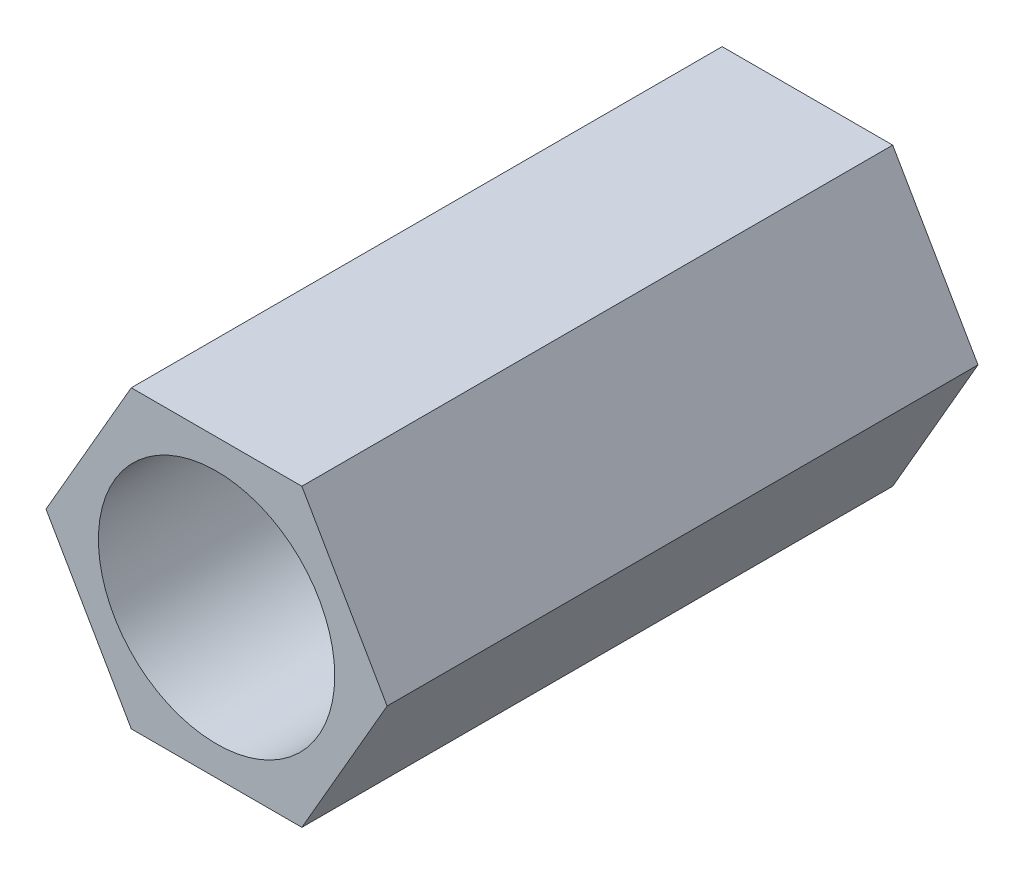
ISO-10303-21;
HEADER;
FILE_DESCRIPTION(('STEP AP214'),'2;1');
FILE_NAME('part.step','',(''),(''),'','','');
FILE_SCHEMA(('AUTOMOTIVE_DESIGN { 1 0 10303 214 1 1 1 1 }'));
ENDSEC;
DATA;
#1=APPLICATION_CONTEXT('core data for automotive mechanical design processes');
#2=APPLICATION_PROTOCOL_DEFINITION('international standard','automotive_design',2000,#1);
#3=PRODUCT_CONTEXT('',#1,'mechanical');
#4=PRODUCT('Part','Part','',(#3));
#5=PRODUCT_RELATED_PRODUCT_CATEGORY('part','',(#4));
#6=PRODUCT_DEFINITION_FORMATION('','',#4);
#7=PRODUCT_DEFINITION_CONTEXT('part definition',#1,'design');
#8=PRODUCT_DEFINITION('design','',#6,#7);
#9=PRODUCT_DEFINITION_SHAPE('','',#8);
#10=(LENGTH_UNIT() NAMED_UNIT(*) SI_UNIT(.MILLI.,.METRE.));
#11=(NAMED_UNIT(*) PLANE_ANGLE_UNIT() SI_UNIT($,.RADIAN.));
#12=(NAMED_UNIT(*) SI_UNIT($,.STERADIAN.) SOLID_ANGLE_UNIT());
#13=UNCERTAINTY_MEASURE_WITH_UNIT(LENGTH_MEASURE(1.E-05),#10,'distance_accuracy_value','');
#14=(GEOMETRIC_REPRESENTATION_CONTEXT(3) GLOBAL_UNCERTAINTY_ASSIGNED_CONTEXT((#13)) GLOBAL_UNIT_ASSIGNED_CONTEXT((#10,
#11,#12)) REPRESENTATION_CONTEXT('',''));
#15=CARTESIAN_POINT('',(0.,0.,0.));
#16=DIRECTION('',(0.,0.,1.));
#17=DIRECTION('',(1.,0.,0.));
#18=AXIS2_PLACEMENT_3D('',#15,#16,#17);
#19=CARTESIAN_POINT('',(2.88675134594818,-4.99999999999995,20.));
#20=DIRECTION('',(-0.866025403784442,0.499999999999995,0.));
#21=DIRECTION('',(-0.499999999999995,-0.866025403784442,0.));
#22=AXIS2_PLACEMENT_3D('',#19,#20,#21);
#23=PLANE('',#22);
#24=DIRECTION('',(0.499999999999995,0.866025403784442,0.));
#25=VECTOR('',#24,1.);
#26=CARTESIAN_POINT('',(2.88675134594818,-4.99999999999995,0.));
#27=LINE('',#26,#25);
#28=CARTESIAN_POINT('',(2.88675134594818,-4.99999999999995,0.));
#29=VERTEX_POINT('',#28);
#30=CARTESIAN_POINT('',(5.77350269189624,0.,0.));
#31=VERTEX_POINT('',#30);
#32=EDGE_CURVE('E118',#29,#31,#27,.T.);
#33=ORIENTED_EDGE('',*,*,#32,.T.);
#34=DIRECTION('',(0.,0.,-1.));
#35=VECTOR('',#34,1.);
#36=CARTESIAN_POINT('',(5.77350269189624,0.,20.));
#37=LINE('',#36,#35);
#38=CARTESIAN_POINT('',(5.77350269189624,0.,20.));
#39=VERTEX_POINT('',#38);
#40=EDGE_CURVE('E11',#39,#31,#37,.T.);
#41=ORIENTED_EDGE('',*,*,#40,.F.);
#42=DIRECTION('',(0.499999999999995,0.866025403784442,0.));
#43=VECTOR('',#42,1.);
#44=CARTESIAN_POINT('',(2.88675134594818,-4.99999999999995,20.));
#45=LINE('',#44,#43);
#46=CARTESIAN_POINT('',(2.88675134594818,-4.99999999999995,20.));
#47=VERTEX_POINT('',#46);
#48=EDGE_CURVE('E129',#47,#39,#45,.T.);
#49=ORIENTED_EDGE('',*,*,#48,.F.);
#50=DIRECTION('',(0.,0.,-1.));
#51=VECTOR('',#50,1.);
#52=CARTESIAN_POINT('',(2.88675134594818,-4.99999999999995,20.));
#53=LINE('',#52,#51);
#54=EDGE_CURVE('E114',#47,#29,#53,.T.);
#55=ORIENTED_EDGE('',*,*,#54,.T.);
#56=EDGE_LOOP('',(#33,#41,#49,#55));
#57=FACE_BOUND('',#56,.T.);
#58=ADVANCED_FACE('F34',(#57),#23,.F.);
#59=CARTESIAN_POINT('',(5.77350269189624,0.,20.));
#60=DIRECTION('',(-0.866025403784438,-0.500000000000001,0.));
#61=DIRECTION('',(0.500000000000001,-0.866025403784438,0.));
#62=AXIS2_PLACEMENT_3D('',#59,#60,#61);
#63=PLANE('',#62);
#64=DIRECTION('',(-0.500000000000001,0.866025403784438,0.));
#65=VECTOR('',#64,1.);
#66=CARTESIAN_POINT('',(5.77350269189624,0.,0.));
#67=LINE('',#66,#65);
#68=CARTESIAN_POINT('',(2.88675134594811,4.99999999999999,0.));
#69=VERTEX_POINT('',#68);
#70=EDGE_CURVE('E121',#31,#69,#67,.T.);
#71=ORIENTED_EDGE('',*,*,#70,.T.);
#72=DIRECTION('',(0.,0.,-1.));
#73=VECTOR('',#72,1.);
#74=CARTESIAN_POINT('',(2.88675134594811,4.99999999999999,20.));
#75=LINE('',#74,#73);
#76=CARTESIAN_POINT('',(2.88675134594811,4.99999999999999,20.));
#77=VERTEX_POINT('',#76);
#78=EDGE_CURVE('E42',#77,#69,#75,.T.);
#79=ORIENTED_EDGE('',*,*,#78,.F.);
#80=DIRECTION('',(-0.500000000000001,0.866025403784438,0.));
#81=VECTOR('',#80,1.);
#82=CARTESIAN_POINT('',(5.77350269189624,0.,20.));
#83=LINE('',#82,#81);
#84=EDGE_CURVE('E87',#39,#77,#83,.T.);
#85=ORIENTED_EDGE('',*,*,#84,.F.);
#86=ORIENTED_EDGE('',*,*,#40,.T.);
#87=EDGE_LOOP('',(#71,#79,#85,#86));
#88=FACE_BOUND('',#87,.T.);
#89=ADVANCED_FACE('F154',(#88),#63,.F.);
#90=CARTESIAN_POINT('',(2.88675134594811,4.99999999999999,20.));
#91=DIRECTION('',(0.,-1.,0.));
#92=DIRECTION('',(1.,0.,0.));
#93=AXIS2_PLACEMENT_3D('',#90,#91,#92);
#94=PLANE('',#93);
#95=DIRECTION('',(-1.,0.,0.));
#96=VECTOR('',#95,1.);
#97=CARTESIAN_POINT('',(2.88675134594811,4.99999999999999,0.));
#98=LINE('',#97,#96);
#99=CARTESIAN_POINT('',(-2.88675134594814,4.99999999999997,0.));
#100=VERTEX_POINT('',#99);
#101=EDGE_CURVE('E124',#69,#100,#98,.T.);
#102=ORIENTED_EDGE('',*,*,#101,.T.);
#103=DIRECTION('',(0.,0.,-1.));
#104=VECTOR('',#103,1.);
#105=CARTESIAN_POINT('',(-2.88675134594814,4.99999999999997,20.));
#106=LINE('',#105,#104);
#107=CARTESIAN_POINT('',(-2.88675134594814,4.99999999999997,20.));
#108=VERTEX_POINT('',#107);
#109=EDGE_CURVE('E109',#108,#100,#106,.T.);
#110=ORIENTED_EDGE('',*,*,#109,.F.);
#111=DIRECTION('',(-1.,0.,0.));
#112=VECTOR('',#111,1.);
#113=CARTESIAN_POINT('',(2.88675134594811,4.99999999999999,20.));
#114=LINE('',#113,#112);
#115=EDGE_CURVE('E100',#77,#108,#114,.T.);
#116=ORIENTED_EDGE('',*,*,#115,.F.);
#117=ORIENTED_EDGE('',*,*,#78,.T.);
#118=EDGE_LOOP('',(#102,#110,#116,#117));
#119=FACE_BOUND('',#118,.T.);
#120=ADVANCED_FACE('F135',(#119),#94,.F.);
#121=CARTESIAN_POINT('',(-2.88675134594814,4.99999999999997,20.));
#122=DIRECTION('',(0.866025403784442,-0.499999999999995,0.));
#123=DIRECTION('',(0.499999999999995,0.866025403784442,0.));
#124=AXIS2_PLACEMENT_3D('',#121,#122,#123);
#125=PLANE('',#124);
#126=DIRECTION('',(-0.499999999999995,-0.866025403784441,0.));
#127=VECTOR('',#126,1.);
#128=CARTESIAN_POINT('',(-2.88675134594814,4.99999999999997,0.));
#129=LINE('',#128,#127);
#130=CARTESIAN_POINT('',(-5.77350269189624,0.,0.));
#131=VERTEX_POINT('',#130);
#132=EDGE_CURVE('E108',#100,#131,#129,.T.);
#133=ORIENTED_EDGE('',*,*,#132,.T.);
#134=DIRECTION('',(0.,0.,-1.));
#135=VECTOR('',#134,1.);
#136=CARTESIAN_POINT('',(-5.77350269189624,0.,20.));
#137=LINE('',#136,#135);
#138=CARTESIAN_POINT('',(-5.77350269189624,0.,20.));
#139=VERTEX_POINT('',#138);
#140=EDGE_CURVE('E105',#139,#131,#137,.T.);
#141=ORIENTED_EDGE('',*,*,#140,.F.);
#142=DIRECTION('',(-0.499999999999995,-0.866025403784441,0.));
#143=VECTOR('',#142,1.);
#144=CARTESIAN_POINT('',(-2.88675134594814,4.99999999999997,20.));
#145=LINE('',#144,#143);
#146=EDGE_CURVE('E94',#108,#139,#145,.T.);
#147=ORIENTED_EDGE('',*,*,#146,.F.);
#148=ORIENTED_EDGE('',*,*,#109,.T.);
#149=EDGE_LOOP('',(#133,#141,#147,#148));
#150=FACE_BOUND('',#149,.T.);
#151=ADVANCED_FACE('F106',(#150),#125,.F.);
#152=CARTESIAN_POINT('',(-5.77350269189624,0.,20.));
#153=DIRECTION('',(0.866025403784434,0.500000000000007,0.));
#154=DIRECTION('',(-0.500000000000007,0.866025403784435,0.));
#155=AXIS2_PLACEMENT_3D('',#152,#153,#154);
#156=PLANE('',#155);
#157=DIRECTION('',(0.500000000000007,-0.866025403784434,0.));
#158=VECTOR('',#157,1.);
#159=CARTESIAN_POINT('',(-5.77350269189624,0.,0.));
#160=LINE('',#159,#158);
#161=CARTESIAN_POINT('',(-2.88675134594807,-5.00000000000001,0.));
#162=VERTEX_POINT('',#161);
#163=EDGE_CURVE('E73',#131,#162,#160,.T.);
#164=ORIENTED_EDGE('',*,*,#163,.T.);
#165=DIRECTION('',(0.,0.,-1.));
#166=VECTOR('',#165,1.);
#167=CARTESIAN_POINT('',(-2.88675134594807,-5.00000000000001,20.));
#168=LINE('',#167,#166);
#169=CARTESIAN_POINT('',(-2.88675134594807,-5.00000000000001,20.));
#170=VERTEX_POINT('',#169);
#171=EDGE_CURVE('E110',#170,#162,#168,.T.);
#172=ORIENTED_EDGE('',*,*,#171,.F.);
#173=DIRECTION('',(0.500000000000007,-0.866025403784434,0.));
#174=VECTOR('',#173,1.);
#175=CARTESIAN_POINT('',(-5.77350269189624,0.,20.));
#176=LINE('',#175,#174);
#177=EDGE_CURVE('E98',#139,#170,#176,.T.);
#178=ORIENTED_EDGE('',*,*,#177,.F.);
#179=ORIENTED_EDGE('',*,*,#140,.T.);
#180=EDGE_LOOP('',(#164,#172,#178,#179));
#181=FACE_BOUND('',#180,.T.);
#182=ADVANCED_FACE('F112',(#181),#156,.F.);
#183=CARTESIAN_POINT('',(-2.88675134594807,-5.00000000000001,20.));
#184=DIRECTION('',(0.,1.,0.));
#185=DIRECTION('',(-1.,0.,0.));
#186=AXIS2_PLACEMENT_3D('',#183,#184,#185);
#187=PLANE('',#186);
#188=DIRECTION('',(1.,0.,0.));
#189=VECTOR('',#188,1.);
#190=CARTESIAN_POINT('',(-2.88675134594807,-5.00000000000001,0.));
#191=LINE('',#190,#189);
#192=EDGE_CURVE('E79',#162,#29,#191,.T.);
#193=ORIENTED_EDGE('',*,*,#192,.T.);
#194=ORIENTED_EDGE('',*,*,#54,.F.);
#195=DIRECTION('',(1.,0.,0.));
#196=VECTOR('',#195,1.);
#197=CARTESIAN_POINT('',(-2.88675134594807,-5.00000000000001,20.));
#198=LINE('',#197,#196);
#199=EDGE_CURVE('E50',#170,#47,#198,.T.);
#200=ORIENTED_EDGE('',*,*,#199,.F.);
#201=ORIENTED_EDGE('',*,*,#171,.T.);
#202=EDGE_LOOP('',(#193,#194,#200,#201));
#203=FACE_BOUND('',#202,.T.);
#204=ADVANCED_FACE('F142',(#203),#187,.F.);
#205=CARTESIAN_POINT('',(0.,0.,20.));
#206=DIRECTION('',(0.,0.,1.));
#207=DIRECTION('',(1.,0.,0.));
#208=AXIS2_PLACEMENT_3D('',#205,#206,#207);
#209=PLANE('',#208);
#210=CARTESIAN_POINT('',(0.,0.,20.));
#211=DIRECTION('',(0.,0.,1.));
#212=DIRECTION('',(1.,0.,0.));
#213=AXIS2_PLACEMENT_3D('',#210,#211,#212);
#214=CIRCLE('',#213,4.);
#215=CARTESIAN_POINT('',(4.,0.,20.));
#216=VERTEX_POINT('',#215);
#217=EDGE_CURVE('E209',#216,#216,#214,.T.);
#218=ORIENTED_EDGE('',*,*,#217,.F.);
#219=EDGE_LOOP('',(#218));
#220=FACE_BOUND('',#219,.T.);
#221=ORIENTED_EDGE('',*,*,#48,.T.);
#222=ORIENTED_EDGE('',*,*,#84,.T.);
#223=ORIENTED_EDGE('',*,*,#115,.T.);
#224=ORIENTED_EDGE('',*,*,#146,.T.);
#225=ORIENTED_EDGE('',*,*,#177,.T.);
#226=ORIENTED_EDGE('',*,*,#199,.T.);
#227=EDGE_LOOP('',(#221,#222,#223,#224,#225,#226));
#228=FACE_BOUND('',#227,.T.);
#229=ADVANCED_FACE('F96',(#220,#228),#209,.T.);
#230=CARTESIAN_POINT('',(0.,0.,0.));
#231=DIRECTION('',(0.,0.,1.));
#232=DIRECTION('',(1.,0.,0.));
#233=AXIS2_PLACEMENT_3D('',#230,#231,#232);
#234=PLANE('',#233);
#235=CARTESIAN_POINT('',(0.,0.,0.));
#236=DIRECTION('',(0.,0.,1.));
#237=DIRECTION('',(1.,0.,0.));
#238=AXIS2_PLACEMENT_3D('',#235,#236,#237);
#239=CIRCLE('',#238,4.);
#240=CARTESIAN_POINT('',(4.,0.,0.));
#241=VERTEX_POINT('',#240);
#242=EDGE_CURVE('E122',#241,#241,#239,.T.);
#243=ORIENTED_EDGE('',*,*,#242,.T.);
#244=EDGE_LOOP('',(#243));
#245=FACE_BOUND('',#244,.T.);
#246=ORIENTED_EDGE('',*,*,#32,.F.);
#247=ORIENTED_EDGE('',*,*,#192,.F.);
#248=ORIENTED_EDGE('',*,*,#163,.F.);
#249=ORIENTED_EDGE('',*,*,#132,.F.);
#250=ORIENTED_EDGE('',*,*,#101,.F.);
#251=ORIENTED_EDGE('',*,*,#70,.F.);
#252=EDGE_LOOP('',(#246,#247,#248,#249,#250,#251));
#253=FACE_BOUND('',#252,.T.);
#254=ADVANCED_FACE('F138',(#245,#253),#234,.F.);
#255=CARTESIAN_POINT('',(0.,0.,0.));
#256=DIRECTION('',(0.,0.,1.));
#257=DIRECTION('',(1.,0.,0.));
#258=AXIS2_PLACEMENT_3D('',#255,#256,#257);
#259=CYLINDRICAL_SURFACE('',#258,4.);
#260=ORIENTED_EDGE('',*,*,#242,.F.);
#261=EDGE_LOOP('',(#260));
#262=FACE_BOUND('',#261,.T.);
#263=ORIENTED_EDGE('',*,*,#217,.T.);
#264=EDGE_LOOP('',(#263));
#265=FACE_BOUND('',#264,.T.);
#266=ADVANCED_FACE('F191',(#262,#265),#259,.F.);
#267=CLOSED_SHELL('',(#58,#89,#120,#151,#182,#204,#229,#254,#266));
#268=MANIFOLD_SOLID_BREP('B2',#267);
#269=ADVANCED_BREP_SHAPE_REPRESENTATION('',(#18,#268),#14);
#270=SHAPE_DEFINITION_REPRESENTATION(#9,#269);
ENDSEC;
END-ISO-10303-21;
